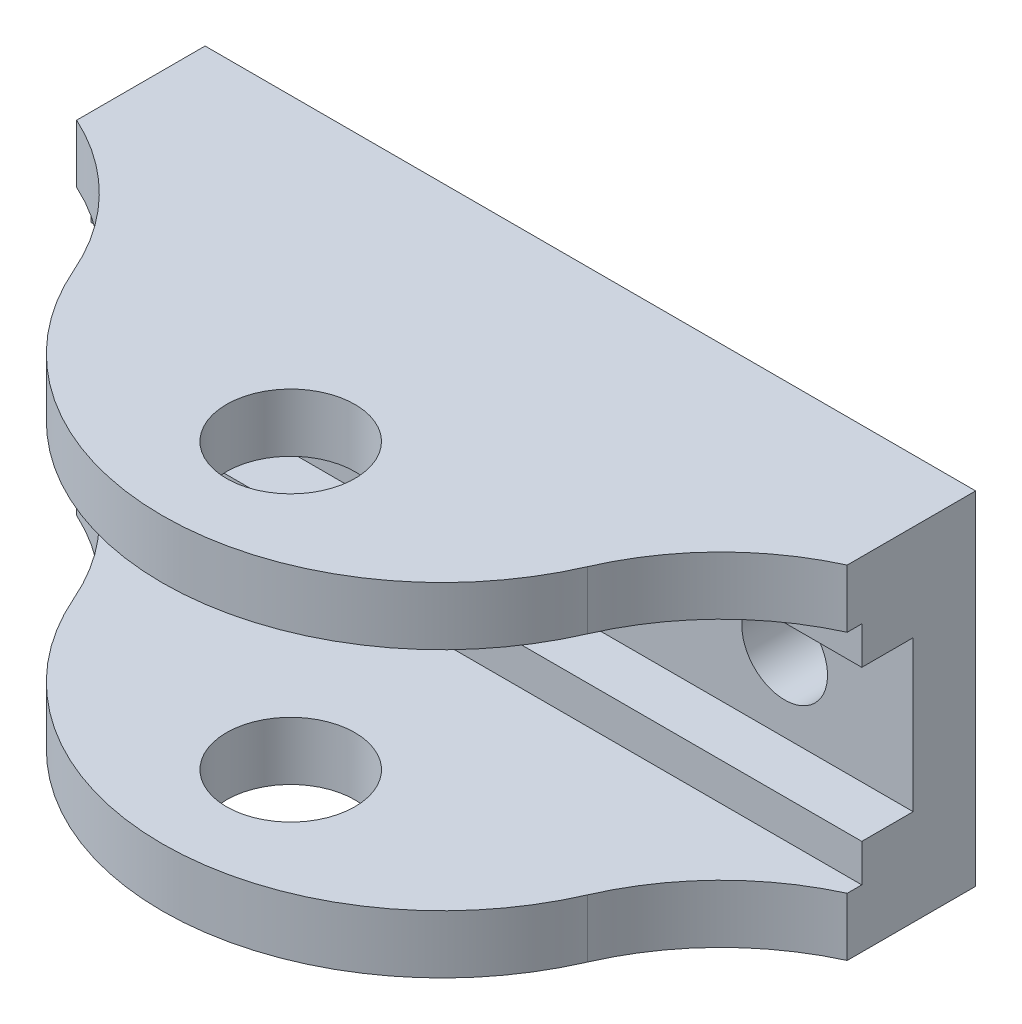
ISO-10303-21;
HEADER;
FILE_DESCRIPTION(('STEP AP214'),'2;1');
FILE_NAME('part.step','',(''),(''),'','','');
FILE_SCHEMA(('AUTOMOTIVE_DESIGN { 1 0 10303 214 1 1 1 1 }'));
ENDSEC;
DATA;
#1=APPLICATION_CONTEXT('core data for automotive mechanical design processes');
#2=APPLICATION_PROTOCOL_DEFINITION('international standard','automotive_design',2000,#1);
#3=PRODUCT_CONTEXT('',#1,'mechanical');
#4=PRODUCT('Part','Part','',(#3));
#5=PRODUCT_RELATED_PRODUCT_CATEGORY('part','',(#4));
#6=PRODUCT_DEFINITION_FORMATION('','',#4);
#7=PRODUCT_DEFINITION_CONTEXT('part definition',#1,'design');
#8=PRODUCT_DEFINITION('design','',#6,#7);
#9=PRODUCT_DEFINITION_SHAPE('','',#8);
#10=(LENGTH_UNIT() NAMED_UNIT(*) SI_UNIT(.MILLI.,.METRE.));
#11=(NAMED_UNIT(*) PLANE_ANGLE_UNIT() SI_UNIT($,.RADIAN.));
#12=(NAMED_UNIT(*) SI_UNIT($,.STERADIAN.) SOLID_ANGLE_UNIT());
#13=UNCERTAINTY_MEASURE_WITH_UNIT(LENGTH_MEASURE(1.E-05),#10,'distance_accuracy_value','');
#14=(GEOMETRIC_REPRESENTATION_CONTEXT(3) GLOBAL_UNCERTAINTY_ASSIGNED_CONTEXT((#13)) GLOBAL_UNIT_ASSIGNED_CONTEXT((#10,
#11,#12)) REPRESENTATION_CONTEXT('',''));
#15=CARTESIAN_POINT('',(0.,0.,0.));
#16=DIRECTION('',(0.,0.,1.));
#17=DIRECTION('',(1.,0.,0.));
#18=AXIS2_PLACEMENT_3D('',#15,#16,#17);
#19=CARTESIAN_POINT('',(-28.575,12.7,38.1));
#20=DIRECTION('',(1.,0.,0.));
#21=DIRECTION('',(0.,0.,-1.));
#22=AXIS2_PLACEMENT_3D('',#19,#20,#21);
#23=PLANE('',#22);
#24=DIRECTION('',(0.,1.,0.));
#25=VECTOR('',#24,1.);
#26=CARTESIAN_POINT('',(-28.575,-12.7000000000001,9.525));
#27=LINE('',#26,#25);
#28=CARTESIAN_POINT('',(-28.575,8.382,9.525));
#29=VERTEX_POINT('',#28);
#30=CARTESIAN_POINT('',(-28.575,12.6999999999999,9.525));
#31=VERTEX_POINT('',#30);
#32=EDGE_CURVE('E49',#29,#31,#27,.T.);
#33=ORIENTED_EDGE('',*,*,#32,.T.);
#34=DIRECTION('',(0.,0.,-1.));
#35=VECTOR('',#34,1.);
#36=CARTESIAN_POINT('',(-28.575,12.7,38.1));
#37=LINE('',#36,#35);
#38=CARTESIAN_POINT('',(-28.575,12.7,0.));
#39=VERTEX_POINT('',#38);
#40=EDGE_CURVE('E280',#31,#39,#37,.T.);
#41=ORIENTED_EDGE('',*,*,#40,.T.);
#42=DIRECTION('',(0.,-1.,0.));
#43=VECTOR('',#42,1.);
#44=CARTESIAN_POINT('',(-28.575,12.7,0.));
#45=LINE('',#44,#43);
#46=CARTESIAN_POINT('',(-28.575,-12.7,0.));
#47=VERTEX_POINT('',#46);
#48=EDGE_CURVE('E262',#39,#47,#45,.T.);
#49=ORIENTED_EDGE('',*,*,#48,.T.);
#50=DIRECTION('',(0.,0.,-1.));
#51=VECTOR('',#50,1.);
#52=CARTESIAN_POINT('',(-28.575,-12.7,38.1));
#53=LINE('',#52,#51);
#54=CARTESIAN_POINT('',(-28.575,-12.7000000000001,9.525));
#55=VERTEX_POINT('',#54);
#56=EDGE_CURVE('E278',#55,#47,#53,.T.);
#57=ORIENTED_EDGE('',*,*,#56,.F.);
#58=CARTESIAN_POINT('',(-28.575,-8.382,9.525));
#59=VERTEX_POINT('',#58);
#60=EDGE_CURVE('E148',#55,#59,#27,.T.);
#61=ORIENTED_EDGE('',*,*,#60,.T.);
#62=DIRECTION('',(0.,0.,1.));
#63=VECTOR('',#62,1.);
#64=CARTESIAN_POINT('',(-28.575,-8.382,-54.9224901944315));
#65=LINE('',#64,#63);
#66=CARTESIAN_POINT('',(-28.575,-8.382,8.4455));
#67=VERTEX_POINT('',#66);
#68=EDGE_CURVE('E208',#67,#59,#65,.T.);
#69=ORIENTED_EDGE('',*,*,#68,.F.);
#70=DIRECTION('',(0.,-1.,0.));
#71=VECTOR('',#70,1.);
#72=CARTESIAN_POINT('',(-28.575,8.382,8.4455));
#73=LINE('',#72,#71);
#74=CARTESIAN_POINT('',(-28.575,-5.588,8.4455));
#75=VERTEX_POINT('',#74);
#76=EDGE_CURVE('E209',#75,#67,#73,.T.);
#77=ORIENTED_EDGE('',*,*,#76,.F.);
#78=DIRECTION('',(0.,0.,1.));
#79=VECTOR('',#78,1.);
#80=CARTESIAN_POINT('',(-28.575,-5.588,-58.2325121903563));
#81=LINE('',#80,#79);
#82=CARTESIAN_POINT('',(-28.575,-5.588,4.63549999999999));
#83=VERTEX_POINT('',#82);
#84=EDGE_CURVE('E236',#83,#75,#81,.T.);
#85=ORIENTED_EDGE('',*,*,#84,.F.);
#86=DIRECTION('',(0.,-1.,0.));
#87=VECTOR('',#86,1.);
#88=CARTESIAN_POINT('',(-28.575,5.588,4.63549999999999));
#89=LINE('',#88,#87);
#90=CARTESIAN_POINT('',(-28.575,5.588,4.63549999999999));
#91=VERTEX_POINT('',#90);
#92=EDGE_CURVE('E233',#91,#83,#89,.T.);
#93=ORIENTED_EDGE('',*,*,#92,.F.);
#94=DIRECTION('',(0.,0.,1.));
#95=VECTOR('',#94,1.);
#96=CARTESIAN_POINT('',(-28.575,5.588,-58.2325121903563));
#97=LINE('',#96,#95);
#98=CARTESIAN_POINT('',(-28.575,5.588,8.44549999999997));
#99=VERTEX_POINT('',#98);
#100=EDGE_CURVE('E237',#91,#99,#97,.T.);
#101=ORIENTED_EDGE('',*,*,#100,.T.);
#102=CARTESIAN_POINT('',(-28.575,8.382,8.4455));
#103=VERTEX_POINT('',#102);
#104=EDGE_CURVE('E206',#103,#99,#73,.T.);
#105=ORIENTED_EDGE('',*,*,#104,.F.);
#106=DIRECTION('',(0.,0.,1.));
#107=VECTOR('',#106,1.);
#108=CARTESIAN_POINT('',(-28.575,8.382,-54.9224901944315));
#109=LINE('',#108,#107);
#110=EDGE_CURVE('E213',#103,#29,#109,.T.);
#111=ORIENTED_EDGE('',*,*,#110,.T.);
#112=EDGE_LOOP('',(#33,#41,#49,#57,#61,#69,#77,#85,#93,#101,#105,#111));
#113=FACE_BOUND('',#112,.T.);
#114=ADVANCED_FACE('F35',(#113),#23,.F.);
#115=CARTESIAN_POINT('',(28.575,12.7,0.));
#116=DIRECTION('',(0.,0.,-1.));
#117=DIRECTION('',(-1.,0.,0.));
#118=AXIS2_PLACEMENT_3D('',#115,#116,#117);
#119=PLANE('',#118);
#120=CARTESIAN_POINT('',(19.05,0.,0.));
#121=DIRECTION('',(0.,0.,1.));
#122=DIRECTION('',(1.,0.,0.));
#123=AXIS2_PLACEMENT_3D('',#120,#121,#122);
#124=CIRCLE('',#123,3.175);
#125=CARTESIAN_POINT('',(22.225,0.,0.));
#126=VERTEX_POINT('',#125);
#127=EDGE_CURVE('E259',#126,#126,#124,.T.);
#128=ORIENTED_EDGE('',*,*,#127,.T.);
#129=EDGE_LOOP('',(#128));
#130=FACE_BOUND('',#129,.T.);
#131=ORIENTED_EDGE('',*,*,#48,.F.);
#132=DIRECTION('',(-1.,0.,0.));
#133=VECTOR('',#132,1.);
#134=CARTESIAN_POINT('',(22.225,12.7,0.));
#135=LINE('',#134,#133);
#136=CARTESIAN_POINT('',(28.575,12.7,0.));
#137=VERTEX_POINT('',#136);
#138=EDGE_CURVE('E271',#137,#39,#135,.T.);
#139=ORIENTED_EDGE('',*,*,#138,.F.);
#140=DIRECTION('',(0.,1.,0.));
#141=VECTOR('',#140,1.);
#142=CARTESIAN_POINT('',(28.575,12.7,0.));
#143=LINE('',#142,#141);
#144=CARTESIAN_POINT('',(28.575,-12.7,0.));
#145=VERTEX_POINT('',#144);
#146=EDGE_CURVE('E268',#145,#137,#143,.T.);
#147=ORIENTED_EDGE('',*,*,#146,.F.);
#148=DIRECTION('',(1.,0.,0.));
#149=VECTOR('',#148,1.);
#150=CARTESIAN_POINT('',(28.575,-12.7,0.));
#151=LINE('',#150,#149);
#152=EDGE_CURVE('E265',#47,#145,#151,.T.);
#153=ORIENTED_EDGE('',*,*,#152,.F.);
#154=EDGE_LOOP('',(#131,#139,#147,#153));
#155=FACE_BOUND('',#154,.T.);
#156=CARTESIAN_POINT('',(-19.05,0.,0.));
#157=DIRECTION('',(0.,0.,1.));
#158=DIRECTION('',(1.,0.,0.));
#159=AXIS2_PLACEMENT_3D('',#156,#157,#158);
#160=CIRCLE('',#159,3.175);
#161=CARTESIAN_POINT('',(-15.875,0.,0.));
#162=VERTEX_POINT('',#161);
#163=EDGE_CURVE('E256',#162,#162,#160,.T.);
#164=ORIENTED_EDGE('',*,*,#163,.T.);
#165=EDGE_LOOP('',(#164));
#166=FACE_BOUND('',#165,.T.);
#167=ADVANCED_FACE('F333',(#130,#155,#166),#119,.T.);
#168=CARTESIAN_POINT('',(28.575,-12.7,38.1));
#169=DIRECTION('',(0.,1.,0.));
#170=DIRECTION('',(-1.,0.,0.));
#171=AXIS2_PLACEMENT_3D('',#168,#169,#170);
#172=PLANE('',#171);
#173=CARTESIAN_POINT('',(0.,-12.7,22.225));
#174=DIRECTION('',(0.,1.,0.));
#175=DIRECTION('',(-1.,0.,0.));
#176=AXIS2_PLACEMENT_3D('',#173,#174,#175);
#177=CIRCLE('',#176,4.7625);
#178=CARTESIAN_POINT('',(-4.76249999999999,-12.7,22.225));
#179=VERTEX_POINT('',#178);
#180=EDGE_CURVE('E193',#179,#179,#177,.T.);
#181=ORIENTED_EDGE('',*,*,#180,.T.);
#182=EDGE_LOOP('',(#181));
#183=FACE_BOUND('',#182,.T.);
#184=DIRECTION('',(0.,0.,-1.));
#185=VECTOR('',#184,1.);
#186=CARTESIAN_POINT('',(28.575,-12.7,38.1));
#187=LINE('',#186,#185);
#188=CARTESIAN_POINT('',(28.575,-12.7,9.525));
#189=VERTEX_POINT('',#188);
#190=EDGE_CURVE('E276',#189,#145,#187,.T.);
#191=ORIENTED_EDGE('',*,*,#190,.F.);
#192=CARTESIAN_POINT('',(36.5247503499917,-12.7,26.8369602983835));
#193=DIRECTION('',(0.,1.,0.));
#194=DIRECTION('',(-1.,0.,0.));
#195=AXIS2_PLACEMENT_3D('',#192,#193,#194);
#196=CIRCLE('',#195,19.05);
#197=CARTESIAN_POINT('',(19.05,-12.7000000000001,19.2517378095262));
#198=VERTEX_POINT('',#197);
#199=EDGE_CURVE('E152',#189,#198,#196,.T.);
#200=ORIENTED_EDGE('',*,*,#199,.T.);
#201=CARTESIAN_POINT('',(0.,-12.7000000000001,10.9827505268095));
#202=DIRECTION('',(0.,1.,0.));
#203=DIRECTION('',(-1.,0.,0.));
#204=AXIS2_PLACEMENT_3D('',#201,#202,#203);
#205=CIRCLE('',#204,20.7672494731905);
#206=CARTESIAN_POINT('',(-19.05,-12.7000000000001,19.2517378095262));
#207=VERTEX_POINT('',#206);
#208=EDGE_CURVE('E153',#207,#198,#205,.T.);
#209=ORIENTED_EDGE('',*,*,#208,.F.);
#210=CARTESIAN_POINT('',(-36.5247503499917,-12.7000000000001,26.8369602983835));
#211=DIRECTION('',(0.,1.,0.));
#212=DIRECTION('',(-1.,0.,0.));
#213=AXIS2_PLACEMENT_3D('',#210,#211,#212);
#214=CIRCLE('',#213,19.05);
#215=EDGE_CURVE('E145',#55,#207,#214,.F.);
#216=ORIENTED_EDGE('',*,*,#215,.F.);
#217=ORIENTED_EDGE('',*,*,#56,.T.);
#218=ORIENTED_EDGE('',*,*,#152,.T.);
#219=EDGE_LOOP('',(#191,#200,#209,#216,#217,#218));
#220=FACE_BOUND('',#219,.T.);
#221=ADVANCED_FACE('F165',(#183,#220),#172,.F.);
#222=CARTESIAN_POINT('',(28.575,12.7,38.1));
#223=DIRECTION('',(-1.,0.,0.));
#224=DIRECTION('',(0.,0.,1.));
#225=AXIS2_PLACEMENT_3D('',#222,#223,#224);
#226=PLANE('',#225);
#227=DIRECTION('',(0.,0.,-1.));
#228=VECTOR('',#227,1.);
#229=CARTESIAN_POINT('',(28.575,12.7,38.1));
#230=LINE('',#229,#228);
#231=CARTESIAN_POINT('',(28.575,12.7,9.525));
#232=VERTEX_POINT('',#231);
#233=EDGE_CURVE('E274',#232,#137,#230,.T.);
#234=ORIENTED_EDGE('',*,*,#233,.F.);
#235=DIRECTION('',(0.,1.,0.));
#236=VECTOR('',#235,1.);
#237=CARTESIAN_POINT('',(28.575,-12.7,9.525));
#238=LINE('',#237,#236);
#239=CARTESIAN_POINT('',(28.575,8.38199999999999,9.525));
#240=VERTEX_POINT('',#239);
#241=EDGE_CURVE('E184',#240,#232,#238,.T.);
#242=ORIENTED_EDGE('',*,*,#241,.F.);
#243=DIRECTION('',(0.,0.,1.));
#244=VECTOR('',#243,1.);
#245=CARTESIAN_POINT('',(28.575,8.38199999999999,-54.9224901944315));
#246=LINE('',#245,#244);
#247=CARTESIAN_POINT('',(28.575,8.38199999999999,8.4455));
#248=VERTEX_POINT('',#247);
#249=EDGE_CURVE('E214',#248,#240,#246,.T.);
#250=ORIENTED_EDGE('',*,*,#249,.F.);
#251=DIRECTION('',(0.,1.,0.));
#252=VECTOR('',#251,1.);
#253=CARTESIAN_POINT('',(28.575,8.38199999999999,8.4455));
#254=LINE('',#253,#252);
#255=CARTESIAN_POINT('',(28.575,5.58799999999999,8.4455));
#256=VERTEX_POINT('',#255);
#257=EDGE_CURVE('E217',#256,#248,#254,.T.);
#258=ORIENTED_EDGE('',*,*,#257,.F.);
#259=DIRECTION('',(0.,0.,1.));
#260=VECTOR('',#259,1.);
#261=CARTESIAN_POINT('',(28.575,5.58799999999999,-58.2325121903563));
#262=LINE('',#261,#260);
#263=CARTESIAN_POINT('',(28.575,5.58799999999999,4.63549999999999));
#264=VERTEX_POINT('',#263);
#265=EDGE_CURVE('E241',#264,#256,#262,.T.);
#266=ORIENTED_EDGE('',*,*,#265,.F.);
#267=DIRECTION('',(0.,1.,0.));
#268=VECTOR('',#267,1.);
#269=CARTESIAN_POINT('',(28.575,5.58799999999999,4.63549999999999));
#270=LINE('',#269,#268);
#271=CARTESIAN_POINT('',(28.575,-5.58799999999999,4.63549999999999));
#272=VERTEX_POINT('',#271);
#273=EDGE_CURVE('E242',#272,#264,#270,.T.);
#274=ORIENTED_EDGE('',*,*,#273,.F.);
#275=DIRECTION('',(0.,0.,1.));
#276=VECTOR('',#275,1.);
#277=CARTESIAN_POINT('',(28.575,-5.58799999999999,-58.2325121903563));
#278=LINE('',#277,#276);
#279=CARTESIAN_POINT('',(28.575,-5.58799999999999,8.44549999999997));
#280=VERTEX_POINT('',#279);
#281=EDGE_CURVE('E232',#272,#280,#278,.T.);
#282=ORIENTED_EDGE('',*,*,#281,.T.);
#283=CARTESIAN_POINT('',(28.575,-8.38199999999999,8.44549999999997));
#284=VERTEX_POINT('',#283);
#285=EDGE_CURVE('E215',#284,#280,#254,.T.);
#286=ORIENTED_EDGE('',*,*,#285,.F.);
#287=DIRECTION('',(0.,0.,1.));
#288=VECTOR('',#287,1.);
#289=CARTESIAN_POINT('',(28.575,-8.38199999999999,-54.9224901944315));
#290=LINE('',#289,#288);
#291=CARTESIAN_POINT('',(28.575,-8.38199999999999,9.525));
#292=VERTEX_POINT('',#291);
#293=EDGE_CURVE('E205',#284,#292,#290,.T.);
#294=ORIENTED_EDGE('',*,*,#293,.T.);
#295=EDGE_CURVE('E182',#189,#292,#238,.T.);
#296=ORIENTED_EDGE('',*,*,#295,.F.);
#297=ORIENTED_EDGE('',*,*,#190,.T.);
#298=ORIENTED_EDGE('',*,*,#146,.T.);
#299=EDGE_LOOP('',(#234,#242,#250,#258,#266,#274,#282,#286,#294,#296,#297,#298));
#300=FACE_BOUND('',#299,.T.);
#301=ADVANCED_FACE('F301',(#300),#226,.F.);
#302=CARTESIAN_POINT('',(22.225,12.7,38.1));
#303=DIRECTION('',(0.,-1.,0.));
#304=DIRECTION('',(1.,0.,0.));
#305=AXIS2_PLACEMENT_3D('',#302,#303,#304);
#306=PLANE('',#305);
#307=CARTESIAN_POINT('',(0.,12.7,22.225));
#308=DIRECTION('',(0.,1.,0.));
#309=DIRECTION('',(-1.,0.,0.));
#310=AXIS2_PLACEMENT_3D('',#307,#308,#309);
#311=CIRCLE('',#310,4.7625);
#312=CARTESIAN_POINT('',(-4.76250000000001,12.7,22.225));
#313=VERTEX_POINT('',#312);
#314=EDGE_CURVE('E192',#313,#313,#311,.T.);
#315=ORIENTED_EDGE('',*,*,#314,.F.);
#316=EDGE_LOOP('',(#315));
#317=FACE_BOUND('',#316,.T.);
#318=CARTESIAN_POINT('',(0.,12.7,10.9827505268095));
#319=DIRECTION('',(0.,1.,0.));
#320=DIRECTION('',(-1.,0.,0.));
#321=AXIS2_PLACEMENT_3D('',#318,#319,#320);
#322=CIRCLE('',#321,20.7672494731905);
#323=CARTESIAN_POINT('',(-19.05,12.7,19.2517378095262));
#324=VERTEX_POINT('',#323);
#325=CARTESIAN_POINT('',(19.05,12.7,19.2517378095262));
#326=VERTEX_POINT('',#325);
#327=EDGE_CURVE('E173',#324,#326,#322,.T.);
#328=ORIENTED_EDGE('',*,*,#327,.T.);
#329=CARTESIAN_POINT('',(36.5247503499917,12.7,26.8369602983835));
#330=DIRECTION('',(0.,1.,0.));
#331=DIRECTION('',(-1.,0.,0.));
#332=AXIS2_PLACEMENT_3D('',#329,#330,#331);
#333=CIRCLE('',#332,19.05);
#334=EDGE_CURVE('E166',#232,#326,#333,.T.);
#335=ORIENTED_EDGE('',*,*,#334,.F.);
#336=ORIENTED_EDGE('',*,*,#233,.T.);
#337=ORIENTED_EDGE('',*,*,#138,.T.);
#338=ORIENTED_EDGE('',*,*,#40,.F.);
#339=CARTESIAN_POINT('',(-36.5247503499917,12.6999999999999,26.8369602983835));
#340=DIRECTION('',(0.,1.,0.));
#341=DIRECTION('',(-1.,0.,0.));
#342=AXIS2_PLACEMENT_3D('',#339,#340,#341);
#343=CIRCLE('',#342,19.05);
#344=EDGE_CURVE('E169',#31,#324,#343,.F.);
#345=ORIENTED_EDGE('',*,*,#344,.T.);
#346=EDGE_LOOP('',(#328,#335,#336,#337,#338,#345));
#347=FACE_BOUND('',#346,.T.);
#348=ADVANCED_FACE('F326',(#317,#347),#306,.F.);
#349=CARTESIAN_POINT('',(19.05,0.,38.1));
#350=DIRECTION('',(0.,0.,-1.));
#351=DIRECTION('',(-1.,0.,0.));
#352=AXIS2_PLACEMENT_3D('',#349,#350,#351);
#353=CYLINDRICAL_SURFACE('',#352,3.175);
#354=CARTESIAN_POINT('',(19.05,0.,4.6355));
#355=DIRECTION('',(0.,0.,-1.));
#356=DIRECTION('',(-1.,0.,0.));
#357=AXIS2_PLACEMENT_3D('',#354,#355,#356);
#358=CIRCLE('',#357,3.175);
#359=CARTESIAN_POINT('',(15.875,0.,4.6355));
#360=VERTEX_POINT('',#359);
#361=EDGE_CURVE('E253',#360,#360,#358,.T.);
#362=ORIENTED_EDGE('',*,*,#361,.F.);
#363=EDGE_LOOP('',(#362));
#364=FACE_BOUND('',#363,.T.);
#365=ORIENTED_EDGE('',*,*,#127,.F.);
#366=EDGE_LOOP('',(#365));
#367=FACE_BOUND('',#366,.T.);
#368=ADVANCED_FACE('F363',(#364,#367),#353,.F.);
#369=CARTESIAN_POINT('',(-19.05,0.,38.1));
#370=DIRECTION('',(0.,0.,-1.));
#371=DIRECTION('',(-1.,0.,0.));
#372=AXIS2_PLACEMENT_3D('',#369,#370,#371);
#373=CYLINDRICAL_SURFACE('',#372,3.175);
#374=CARTESIAN_POINT('',(-19.05,0.,4.6355));
#375=DIRECTION('',(0.,0.,-1.));
#376=DIRECTION('',(-1.,0.,0.));
#377=AXIS2_PLACEMENT_3D('',#374,#375,#376);
#378=CIRCLE('',#377,3.175);
#379=CARTESIAN_POINT('',(-22.225,0.,4.6355));
#380=VERTEX_POINT('',#379);
#381=EDGE_CURVE('E252',#380,#380,#378,.T.);
#382=ORIENTED_EDGE('',*,*,#381,.F.);
#383=EDGE_LOOP('',(#382));
#384=FACE_BOUND('',#383,.T.);
#385=ORIENTED_EDGE('',*,*,#163,.F.);
#386=EDGE_LOOP('',(#385));
#387=FACE_BOUND('',#386,.T.);
#388=ADVANCED_FACE('F384',(#384,#387),#373,.F.);
#389=CARTESIAN_POINT('',(28.575,12.7,4.6355));
#390=DIRECTION('',(0.,0.,-1.));
#391=DIRECTION('',(-1.,0.,0.));
#392=AXIS2_PLACEMENT_3D('',#389,#390,#391);
#393=PLANE('',#392);
#394=ORIENTED_EDGE('',*,*,#361,.T.);
#395=EDGE_LOOP('',(#394));
#396=FACE_BOUND('',#395,.T.);
#397=ORIENTED_EDGE('',*,*,#381,.T.);
#398=EDGE_LOOP('',(#397));
#399=FACE_BOUND('',#398,.T.);
#400=ORIENTED_EDGE('',*,*,#92,.T.);
#401=DIRECTION('',(1.,0.,0.));
#402=VECTOR('',#401,1.);
#403=CARTESIAN_POINT('',(-28.575,-5.588,4.63549999999999));
#404=LINE('',#403,#402);
#405=EDGE_CURVE('E229',#83,#272,#404,.T.);
#406=ORIENTED_EDGE('',*,*,#405,.T.);
#407=ORIENTED_EDGE('',*,*,#273,.T.);
#408=DIRECTION('',(-1.,0.,0.));
#409=VECTOR('',#408,1.);
#410=CARTESIAN_POINT('',(-28.575,5.588,4.63549999999999));
#411=LINE('',#410,#409);
#412=EDGE_CURVE('E238',#264,#91,#411,.T.);
#413=ORIENTED_EDGE('',*,*,#412,.T.);
#414=EDGE_LOOP('',(#400,#406,#407,#413));
#415=FACE_BOUND('',#414,.T.);
#416=ADVANCED_FACE('F308',(#396,#399,#415),#393,.F.);
#417=CARTESIAN_POINT('',(-28.575,-5.588,-58.2325121903563));
#418=DIRECTION('',(0.,-1.,0.));
#419=DIRECTION('',(1.,0.,0.));
#420=AXIS2_PLACEMENT_3D('',#417,#418,#419);
#421=PLANE('',#420);
#422=ORIENTED_EDGE('',*,*,#84,.T.);
#423=DIRECTION('',(1.,0.,0.));
#424=VECTOR('',#423,1.);
#425=CARTESIAN_POINT('',(-28.575,-5.588,8.4455));
#426=LINE('',#425,#424);
#427=EDGE_CURVE('E226',#75,#280,#426,.T.);
#428=ORIENTED_EDGE('',*,*,#427,.T.);
#429=ORIENTED_EDGE('',*,*,#281,.F.);
#430=ORIENTED_EDGE('',*,*,#405,.F.);
#431=EDGE_LOOP('',(#422,#428,#429,#430));
#432=FACE_BOUND('',#431,.T.);
#433=ADVANCED_FACE('F306',(#432),#421,.F.);
#434=CARTESIAN_POINT('',(-28.575,5.588,-58.2325121903563));
#435=DIRECTION('',(0.,1.,0.));
#436=DIRECTION('',(-1.,0.,0.));
#437=AXIS2_PLACEMENT_3D('',#434,#435,#436);
#438=PLANE('',#437);
#439=ORIENTED_EDGE('',*,*,#265,.T.);
#440=DIRECTION('',(-1.,0.,0.));
#441=VECTOR('',#440,1.);
#442=CARTESIAN_POINT('',(-28.575,5.588,8.4455));
#443=LINE('',#442,#441);
#444=EDGE_CURVE('E282',#256,#99,#443,.T.);
#445=ORIENTED_EDGE('',*,*,#444,.T.);
#446=ORIENTED_EDGE('',*,*,#100,.F.);
#447=ORIENTED_EDGE('',*,*,#412,.F.);
#448=EDGE_LOOP('',(#439,#445,#446,#447));
#449=FACE_BOUND('',#448,.T.);
#450=ADVANCED_FACE('F314',(#449),#438,.F.);
#451=CARTESIAN_POINT('',(28.575,12.7,8.4455));
#452=DIRECTION('',(0.,0.,-1.));
#453=DIRECTION('',(-1.,0.,0.));
#454=AXIS2_PLACEMENT_3D('',#451,#452,#453);
#455=PLANE('',#454);
#456=ORIENTED_EDGE('',*,*,#257,.T.);
#457=DIRECTION('',(-1.,0.,0.));
#458=VECTOR('',#457,1.);
#459=CARTESIAN_POINT('',(-28.575,8.382,8.4455));
#460=LINE('',#459,#458);
#461=EDGE_CURVE('E210',#248,#103,#460,.T.);
#462=ORIENTED_EDGE('',*,*,#461,.T.);
#463=ORIENTED_EDGE('',*,*,#104,.T.);
#464=ORIENTED_EDGE('',*,*,#444,.F.);
#465=EDGE_LOOP('',(#456,#462,#463,#464));
#466=FACE_BOUND('',#465,.T.);
#467=ADVANCED_FACE('F317',(#466),#455,.F.);
#468=CARTESIAN_POINT('',(-28.575,8.382,-54.9224901944315));
#469=DIRECTION('',(0.,1.,0.));
#470=DIRECTION('',(-1.,0.,0.));
#471=AXIS2_PLACEMENT_3D('',#468,#469,#470);
#472=PLANE('',#471);
#473=CARTESIAN_POINT('',(0.,8.382,22.225));
#474=DIRECTION('',(0.,1.,0.));
#475=DIRECTION('',(-1.,0.,0.));
#476=AXIS2_PLACEMENT_3D('',#473,#474,#475);
#477=CIRCLE('',#476,4.7625);
#478=CARTESIAN_POINT('',(-4.76250000000001,8.382,22.225));
#479=VERTEX_POINT('',#478);
#480=EDGE_CURVE('E199',#479,#479,#477,.T.);
#481=ORIENTED_EDGE('',*,*,#480,.T.);
#482=EDGE_LOOP('',(#481));
#483=FACE_BOUND('',#482,.T.);
#484=ORIENTED_EDGE('',*,*,#249,.T.);
#485=CARTESIAN_POINT('',(36.5247503499917,8.38199999999999,26.8369602983835));
#486=DIRECTION('',(0.,1.,0.));
#487=DIRECTION('',(-1.,0.,0.));
#488=AXIS2_PLACEMENT_3D('',#485,#486,#487);
#489=CIRCLE('',#488,19.05);
#490=CARTESIAN_POINT('',(19.05,8.38199999999999,19.2517378095262));
#491=VERTEX_POINT('',#490);
#492=EDGE_CURVE('E187',#240,#491,#489,.T.);
#493=ORIENTED_EDGE('',*,*,#492,.T.);
#494=CARTESIAN_POINT('',(0.,8.382,10.9827505268095));
#495=DIRECTION('',(0.,1.,0.));
#496=DIRECTION('',(-1.,0.,0.));
#497=AXIS2_PLACEMENT_3D('',#494,#495,#496);
#498=CIRCLE('',#497,20.7672494731905);
#499=CARTESIAN_POINT('',(-19.05,8.382,19.2517378095262));
#500=VERTEX_POINT('',#499);
#501=EDGE_CURVE('E190',#500,#491,#498,.T.);
#502=ORIENTED_EDGE('',*,*,#501,.F.);
#503=CARTESIAN_POINT('',(-36.5247503499917,8.382,26.8369602983835));
#504=DIRECTION('',(0.,1.,0.));
#505=DIRECTION('',(-1.,0.,0.));
#506=AXIS2_PLACEMENT_3D('',#503,#504,#505);
#507=CIRCLE('',#506,19.05);
#508=EDGE_CURVE('E180',#29,#500,#507,.F.);
#509=ORIENTED_EDGE('',*,*,#508,.F.);
#510=ORIENTED_EDGE('',*,*,#110,.F.);
#511=ORIENTED_EDGE('',*,*,#461,.F.);
#512=EDGE_LOOP('',(#484,#493,#502,#509,#510,#511));
#513=FACE_BOUND('',#512,.T.);
#514=ADVANCED_FACE('F322',(#483,#513),#472,.F.);
#515=ORIENTED_EDGE('',*,*,#76,.T.);
#516=DIRECTION('',(1.,0.,0.));
#517=VECTOR('',#516,1.);
#518=CARTESIAN_POINT('',(-28.575,-8.382,8.4455));
#519=LINE('',#518,#517);
#520=EDGE_CURVE('E202',#67,#284,#519,.T.);
#521=ORIENTED_EDGE('',*,*,#520,.T.);
#522=ORIENTED_EDGE('',*,*,#285,.T.);
#523=ORIENTED_EDGE('',*,*,#427,.F.);
#524=EDGE_LOOP('',(#515,#521,#522,#523));
#525=FACE_BOUND('',#524,.T.);
#526=ADVANCED_FACE('F298',(#525),#455,.F.);
#527=CARTESIAN_POINT('',(-28.575,-8.382,-54.9224901944315));
#528=DIRECTION('',(0.,-1.,0.));
#529=DIRECTION('',(1.,0.,0.));
#530=AXIS2_PLACEMENT_3D('',#527,#528,#529);
#531=PLANE('',#530);
#532=CARTESIAN_POINT('',(0.,-8.382,22.225));
#533=DIRECTION('',(0.,-1.,0.));
#534=DIRECTION('',(1.,0.,0.));
#535=AXIS2_PLACEMENT_3D('',#532,#533,#534);
#536=CIRCLE('',#535,4.7625);
#537=CARTESIAN_POINT('',(4.76250000000001,-8.382,22.225));
#538=VERTEX_POINT('',#537);
#539=EDGE_CURVE('E196',#538,#538,#536,.T.);
#540=ORIENTED_EDGE('',*,*,#539,.T.);
#541=EDGE_LOOP('',(#540));
#542=FACE_BOUND('',#541,.T.);
#543=CARTESIAN_POINT('',(0.,-8.382,10.9827505268095));
#544=DIRECTION('',(0.,-1.,0.));
#545=DIRECTION('',(1.,0.,0.));
#546=AXIS2_PLACEMENT_3D('',#543,#544,#545);
#547=CIRCLE('',#546,20.7672494731905);
#548=CARTESIAN_POINT('',(19.05,-8.38199999999999,19.2517378095262));
#549=VERTEX_POINT('',#548);
#550=CARTESIAN_POINT('',(-19.05,-8.382,19.2517378095262));
#551=VERTEX_POINT('',#550);
#552=EDGE_CURVE('E42',#549,#551,#547,.T.);
#553=ORIENTED_EDGE('',*,*,#552,.F.);
#554=CARTESIAN_POINT('',(36.5247503499917,-8.38199999999999,26.8369602983835));
#555=DIRECTION('',(0.,-1.,0.));
#556=DIRECTION('',(1.,0.,0.));
#557=AXIS2_PLACEMENT_3D('',#554,#555,#556);
#558=CIRCLE('',#557,19.05);
#559=EDGE_CURVE('E13',#549,#292,#558,.T.);
#560=ORIENTED_EDGE('',*,*,#559,.T.);
#561=ORIENTED_EDGE('',*,*,#293,.F.);
#562=ORIENTED_EDGE('',*,*,#520,.F.);
#563=ORIENTED_EDGE('',*,*,#68,.T.);
#564=CARTESIAN_POINT('',(-36.5247503499917,-8.382,26.8369602983835));
#565=DIRECTION('',(0.,-1.,0.));
#566=DIRECTION('',(1.,0.,0.));
#567=AXIS2_PLACEMENT_3D('',#564,#565,#566);
#568=CIRCLE('',#567,19.05);
#569=EDGE_CURVE('E287',#551,#59,#568,.F.);
#570=ORIENTED_EDGE('',*,*,#569,.F.);
#571=EDGE_LOOP('',(#553,#560,#561,#562,#563,#570));
#572=FACE_BOUND('',#571,.T.);
#573=ADVANCED_FACE('F295',(#542,#572),#531,.F.);
#574=CARTESIAN_POINT('',(0.,-12.7,22.225));
#575=DIRECTION('',(0.,1.,0.));
#576=DIRECTION('',(-1.,0.,0.));
#577=AXIS2_PLACEMENT_3D('',#574,#575,#576);
#578=CYLINDRICAL_SURFACE('',#577,4.7625);
#579=ORIENTED_EDGE('',*,*,#180,.F.);
#580=EDGE_LOOP('',(#579));
#581=FACE_BOUND('',#580,.T.);
#582=ORIENTED_EDGE('',*,*,#539,.F.);
#583=EDGE_LOOP('',(#582));
#584=FACE_BOUND('',#583,.T.);
#585=ADVANCED_FACE('F434',(#581,#584),#578,.F.);
#586=ORIENTED_EDGE('',*,*,#314,.T.);
#587=EDGE_LOOP('',(#586));
#588=FACE_BOUND('',#587,.T.);
#589=ORIENTED_EDGE('',*,*,#480,.F.);
#590=EDGE_LOOP('',(#589));
#591=FACE_BOUND('',#590,.T.);
#592=ADVANCED_FACE('F346',(#588,#591),#578,.F.);
#593=CARTESIAN_POINT('',(-36.5247503499917,-12.7000000000001,26.8369602983835));
#594=DIRECTION('',(0.,1.,0.));
#595=DIRECTION('',(-1.,0.,0.));
#596=AXIS2_PLACEMENT_3D('',#593,#594,#595);
#597=CYLINDRICAL_SURFACE('',#596,19.05);
#598=ORIENTED_EDGE('',*,*,#569,.T.);
#599=ORIENTED_EDGE('',*,*,#60,.F.);
#600=ORIENTED_EDGE('',*,*,#215,.T.);
#601=DIRECTION('',(0.,1.,0.));
#602=VECTOR('',#601,1.);
#603=CARTESIAN_POINT('',(-19.05,-12.7000000000001,19.2517378095262));
#604=LINE('',#603,#602);
#605=EDGE_CURVE('E57',#207,#551,#604,.T.);
#606=ORIENTED_EDGE('',*,*,#605,.T.);
#607=EDGE_LOOP('',(#598,#599,#600,#606));
#608=FACE_BOUND('',#607,.T.);
#609=ADVANCED_FACE('F146',(#608),#597,.F.);
#610=CARTESIAN_POINT('',(36.5247503499917,-12.7,26.8369602983835));
#611=DIRECTION('',(0.,1.,0.));
#612=DIRECTION('',(-1.,0.,0.));
#613=AXIS2_PLACEMENT_3D('',#610,#611,#612);
#614=CYLINDRICAL_SURFACE('',#613,19.05);
#615=DIRECTION('',(0.,1.,0.));
#616=VECTOR('',#615,1.);
#617=CARTESIAN_POINT('',(19.05,-12.7000000000001,19.2517378095262));
#618=LINE('',#617,#616);
#619=EDGE_CURVE('E178',#198,#549,#618,.T.);
#620=ORIENTED_EDGE('',*,*,#619,.F.);
#621=ORIENTED_EDGE('',*,*,#199,.F.);
#622=ORIENTED_EDGE('',*,*,#295,.T.);
#623=ORIENTED_EDGE('',*,*,#559,.F.);
#624=EDGE_LOOP('',(#620,#621,#622,#623));
#625=FACE_BOUND('',#624,.T.);
#626=ADVANCED_FACE('F336',(#625),#614,.F.);
#627=CARTESIAN_POINT('',(0.,-12.7000000000001,10.9827505268095));
#628=DIRECTION('',(0.,1.,0.));
#629=DIRECTION('',(-1.,0.,0.));
#630=AXIS2_PLACEMENT_3D('',#627,#628,#629);
#631=CYLINDRICAL_SURFACE('',#630,20.7672494731905);
#632=ORIENTED_EDGE('',*,*,#552,.T.);
#633=ORIENTED_EDGE('',*,*,#605,.F.);
#634=ORIENTED_EDGE('',*,*,#208,.T.);
#635=ORIENTED_EDGE('',*,*,#619,.T.);
#636=EDGE_LOOP('',(#632,#633,#634,#635));
#637=FACE_BOUND('',#636,.T.);
#638=ADVANCED_FACE('F156',(#637),#631,.T.);
#639=ORIENTED_EDGE('',*,*,#501,.T.);
#640=EDGE_CURVE('E181',#491,#326,#618,.T.);
#641=ORIENTED_EDGE('',*,*,#640,.T.);
#642=ORIENTED_EDGE('',*,*,#327,.F.);
#643=EDGE_CURVE('E161',#500,#324,#604,.T.);
#644=ORIENTED_EDGE('',*,*,#643,.F.);
#645=EDGE_LOOP('',(#639,#641,#642,#644));
#646=FACE_BOUND('',#645,.T.);
#647=ADVANCED_FACE('F344',(#646),#631,.T.);
#648=ORIENTED_EDGE('',*,*,#241,.T.);
#649=ORIENTED_EDGE('',*,*,#334,.T.);
#650=ORIENTED_EDGE('',*,*,#640,.F.);
#651=ORIENTED_EDGE('',*,*,#492,.F.);
#652=EDGE_LOOP('',(#648,#649,#650,#651));
#653=FACE_BOUND('',#652,.T.);
#654=ADVANCED_FACE('F339',(#653),#614,.F.);
#655=ORIENTED_EDGE('',*,*,#508,.T.);
#656=ORIENTED_EDGE('',*,*,#643,.T.);
#657=ORIENTED_EDGE('',*,*,#344,.F.);
#658=ORIENTED_EDGE('',*,*,#32,.F.);
#659=EDGE_LOOP('',(#655,#656,#657,#658));
#660=FACE_BOUND('',#659,.T.);
#661=ADVANCED_FACE('F348',(#660),#597,.F.);
#662=CLOSED_SHELL('',(#114,#167,#221,#301,#348,#368,#388,#416,#433,#450,#467,#514,#526,#573,
#585,#592,#609,#626,#638,#647,#654,#661));
#663=MANIFOLD_SOLID_BREP('B2',#662);
#664=ADVANCED_BREP_SHAPE_REPRESENTATION('',(#18,#663),#14);
#665=SHAPE_DEFINITION_REPRESENTATION(#9,#664);
ENDSEC;
END-ISO-10303-21;
